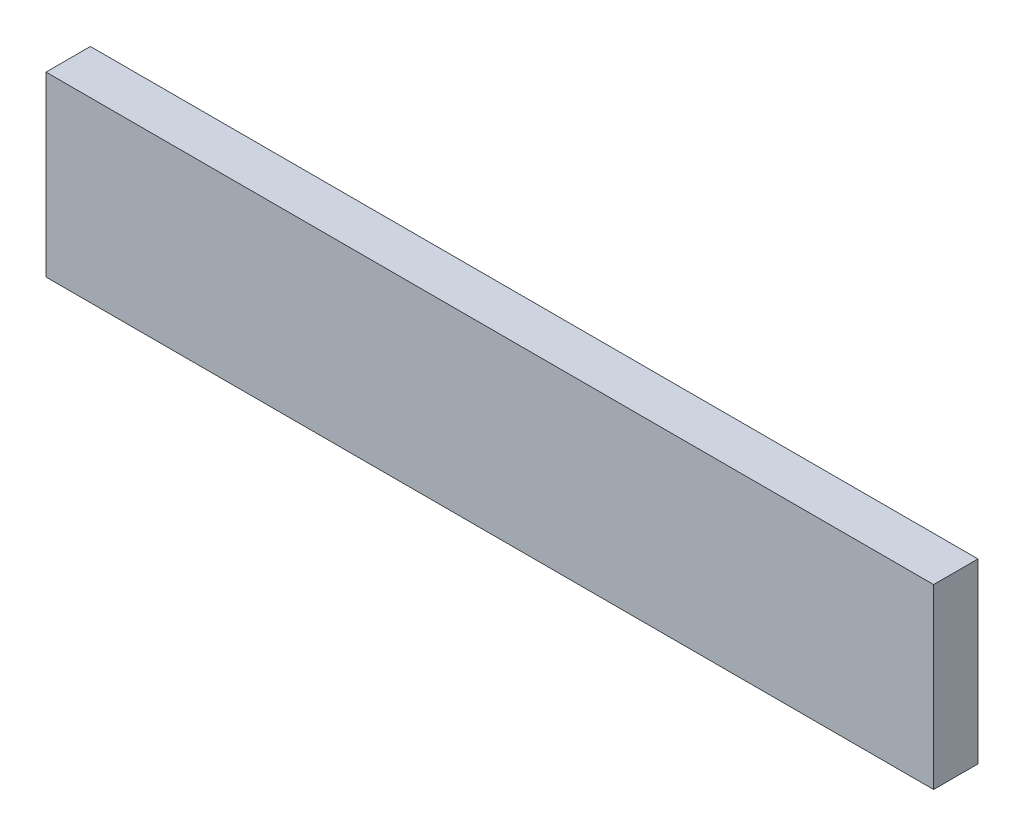
ISO-10303-21;
HEADER;
FILE_DESCRIPTION(('STEP AP214'),'2;1');
FILE_NAME('part.step','',(''),(''),'','','');
FILE_SCHEMA(('AUTOMOTIVE_DESIGN { 1 0 10303 214 1 1 1 1 }'));
ENDSEC;
DATA;
#1=APPLICATION_CONTEXT('core data for automotive mechanical design processes');
#2=APPLICATION_PROTOCOL_DEFINITION('international standard','automotive_design',2000,#1);
#3=PRODUCT_CONTEXT('',#1,'mechanical');
#4=PRODUCT('Part','Part','',(#3));
#5=PRODUCT_RELATED_PRODUCT_CATEGORY('part','',(#4));
#6=PRODUCT_DEFINITION_FORMATION('','',#4);
#7=PRODUCT_DEFINITION_CONTEXT('part definition',#1,'design');
#8=PRODUCT_DEFINITION('design','',#6,#7);
#9=PRODUCT_DEFINITION_SHAPE('','',#8);
#10=(LENGTH_UNIT() NAMED_UNIT(*) SI_UNIT(.MILLI.,.METRE.));
#11=(NAMED_UNIT(*) PLANE_ANGLE_UNIT() SI_UNIT($,.RADIAN.));
#12=(NAMED_UNIT(*) SI_UNIT($,.STERADIAN.) SOLID_ANGLE_UNIT());
#13=UNCERTAINTY_MEASURE_WITH_UNIT(LENGTH_MEASURE(1.E-05),#10,'distance_accuracy_value','');
#14=(GEOMETRIC_REPRESENTATION_CONTEXT(3) GLOBAL_UNCERTAINTY_ASSIGNED_CONTEXT((#13)) GLOBAL_UNIT_ASSIGNED_CONTEXT((#10,
#11,#12)) REPRESENTATION_CONTEXT('',''));
#15=CARTESIAN_POINT('',(0.,0.,0.));
#16=DIRECTION('',(0.,0.,1.));
#17=DIRECTION('',(1.,0.,0.));
#18=AXIS2_PLACEMENT_3D('',#15,#16,#17);
#19=CARTESIAN_POINT('',(-0.09999980000001,0.01999995999999,0.01));
#20=DIRECTION('',(0.,0.,-1.));
#21=DIRECTION('',(-1.,0.,0.));
#22=AXIS2_PLACEMENT_3D('',#19,#20,#21);
#23=PLANE('',#22);
#24=DIRECTION('',(1.,0.,0.));
#25=VECTOR('',#24,1.);
#26=CARTESIAN_POINT('',(-0.09999980000001,-0.01999996000001,0.01));
#27=LINE('',#26,#25);
#28=CARTESIAN_POINT('',(-0.09999980000001,-0.01999996000001,0.01));
#29=VERTEX_POINT('',#28);
#30=CARTESIAN_POINT('',(0.09999979999999,-0.01999996000001,0.01));
#31=VERTEX_POINT('',#30);
#32=EDGE_CURVE('E55',#29,#31,#27,.T.);
#33=ORIENTED_EDGE('',*,*,#32,.T.);
#34=DIRECTION('',(0.,1.,0.));
#35=VECTOR('',#34,1.);
#36=CARTESIAN_POINT('',(0.09999979999999,-0.01999996000001,0.01));
#37=LINE('',#36,#35);
#38=CARTESIAN_POINT('',(0.09999979999999,0.01999995999999,0.01));
#39=VERTEX_POINT('',#38);
#40=EDGE_CURVE('E57',#31,#39,#37,.T.);
#41=ORIENTED_EDGE('',*,*,#40,.T.);
#42=DIRECTION('',(1.,0.,0.));
#43=VECTOR('',#42,1.);
#44=CARTESIAN_POINT('',(0.09999979999999,0.01999995999999,0.01));
#45=LINE('',#44,#43);
#46=CARTESIAN_POINT('',(-0.09999980000001,0.01999995999999,0.01));
#47=VERTEX_POINT('',#46);
#48=EDGE_CURVE('E20',#39,#47,#45,.F.);
#49=ORIENTED_EDGE('',*,*,#48,.T.);
#50=DIRECTION('',(0.,1.,0.));
#51=VECTOR('',#50,1.);
#52=CARTESIAN_POINT('',(-0.09999980000001,0.01999995999999,0.01));
#53=LINE('',#52,#51);
#54=EDGE_CURVE('E80',#47,#29,#53,.F.);
#55=ORIENTED_EDGE('',*,*,#54,.T.);
#56=EDGE_LOOP('',(#33,#41,#49,#55));
#57=FACE_BOUND('',#56,.T.);
#58=ADVANCED_FACE('F17',(#57),#23,.F.);
#59=CARTESIAN_POINT('',(0.09999979999999,0.01999995999999,0.));
#60=DIRECTION('',(0.,-1.,0.));
#61=DIRECTION('',(0.,0.,-1.));
#62=AXIS2_PLACEMENT_3D('',#59,#60,#61);
#63=PLANE('',#62);
#64=DIRECTION('',(0.,0.,-1.));
#65=VECTOR('',#64,1.);
#66=CARTESIAN_POINT('',(-0.09999980000001,0.01999995999999,0.));
#67=LINE('',#66,#65);
#68=CARTESIAN_POINT('',(-0.09999980000001,0.01999995999999,0.));
#69=VERTEX_POINT('',#68);
#70=EDGE_CURVE('E68',#69,#47,#67,.F.);
#71=ORIENTED_EDGE('',*,*,#70,.T.);
#72=ORIENTED_EDGE('',*,*,#48,.F.);
#73=DIRECTION('',(0.,0.,1.));
#74=VECTOR('',#73,1.);
#75=CARTESIAN_POINT('',(0.09999979999999,0.01999995999999,0.));
#76=LINE('',#75,#74);
#77=CARTESIAN_POINT('',(0.09999979999999,0.01999995999999,0.));
#78=VERTEX_POINT('',#77);
#79=EDGE_CURVE('E63',#39,#78,#76,.F.);
#80=ORIENTED_EDGE('',*,*,#79,.T.);
#81=DIRECTION('',(-1.,0.,0.));
#82=VECTOR('',#81,1.);
#83=CARTESIAN_POINT('',(-0.09999980000001,0.01999995999999,0.));
#84=LINE('',#83,#82);
#85=EDGE_CURVE('E83',#69,#78,#84,.F.);
#86=ORIENTED_EDGE('',*,*,#85,.F.);
#87=EDGE_LOOP('',(#71,#72,#80,#86));
#88=FACE_BOUND('',#87,.T.);
#89=ADVANCED_FACE('F65',(#88),#63,.F.);
#90=CARTESIAN_POINT('',(0.09999979999999,-0.01999996000001,0.));
#91=DIRECTION('',(-1.,0.,0.));
#92=DIRECTION('',(0.,0.,1.));
#93=AXIS2_PLACEMENT_3D('',#90,#91,#92);
#94=PLANE('',#93);
#95=ORIENTED_EDGE('',*,*,#79,.F.);
#96=ORIENTED_EDGE('',*,*,#40,.F.);
#97=DIRECTION('',(0.,0.,1.));
#98=VECTOR('',#97,1.);
#99=CARTESIAN_POINT('',(0.09999979999999,-0.01999996000001,0.));
#100=LINE('',#99,#98);
#101=CARTESIAN_POINT('',(0.09999979999999,-0.01999996000001,0.));
#102=VERTEX_POINT('',#101);
#103=EDGE_CURVE('E75',#31,#102,#100,.F.);
#104=ORIENTED_EDGE('',*,*,#103,.T.);
#105=DIRECTION('',(0.,1.,0.));
#106=VECTOR('',#105,1.);
#107=CARTESIAN_POINT('',(0.09999979999999,0.01999995999999,0.));
#108=LINE('',#107,#106);
#109=EDGE_CURVE('E72',#78,#102,#108,.F.);
#110=ORIENTED_EDGE('',*,*,#109,.F.);
#111=EDGE_LOOP('',(#95,#96,#104,#110));
#112=FACE_BOUND('',#111,.T.);
#113=ADVANCED_FACE('F70',(#112),#94,.F.);
#114=CARTESIAN_POINT('',(-0.09999980000001,-0.01999996000001,0.));
#115=DIRECTION('',(0.,1.,0.));
#116=DIRECTION('',(0.,0.,1.));
#117=AXIS2_PLACEMENT_3D('',#114,#115,#116);
#118=PLANE('',#117);
#119=ORIENTED_EDGE('',*,*,#103,.F.);
#120=ORIENTED_EDGE('',*,*,#32,.F.);
#121=DIRECTION('',(0.,0.,-1.));
#122=VECTOR('',#121,1.);
#123=CARTESIAN_POINT('',(-0.09999980000001,-0.01999996000001,0.));
#124=LINE('',#123,#122);
#125=CARTESIAN_POINT('',(-0.09999980000001,-0.01999996000001,0.));
#126=VERTEX_POINT('',#125);
#127=EDGE_CURVE('E35',#29,#126,#124,.T.);
#128=ORIENTED_EDGE('',*,*,#127,.T.);
#129=DIRECTION('',(-1.,0.,0.));
#130=VECTOR('',#129,1.);
#131=CARTESIAN_POINT('',(-0.09999980000001,-0.01999996000001,0.));
#132=LINE('',#131,#130);
#133=EDGE_CURVE('E26',#102,#126,#132,.T.);
#134=ORIENTED_EDGE('',*,*,#133,.F.);
#135=EDGE_LOOP('',(#119,#120,#128,#134));
#136=FACE_BOUND('',#135,.T.);
#137=ADVANCED_FACE('F89',(#136),#118,.F.);
#138=CARTESIAN_POINT('',(-0.09999980000001,0.01999995999999,0.));
#139=DIRECTION('',(1.,0.,0.));
#140=DIRECTION('',(0.,0.,-1.));
#141=AXIS2_PLACEMENT_3D('',#138,#139,#140);
#142=PLANE('',#141);
#143=ORIENTED_EDGE('',*,*,#127,.F.);
#144=ORIENTED_EDGE('',*,*,#54,.F.);
#145=ORIENTED_EDGE('',*,*,#70,.F.);
#146=DIRECTION('',(0.,1.,0.));
#147=VECTOR('',#146,1.);
#148=CARTESIAN_POINT('',(-0.09999980000001,0.01999995999999,0.));
#149=LINE('',#148,#147);
#150=EDGE_CURVE('E11',#126,#69,#149,.T.);
#151=ORIENTED_EDGE('',*,*,#150,.F.);
#152=EDGE_LOOP('',(#143,#144,#145,#151));
#153=FACE_BOUND('',#152,.T.);
#154=ADVANCED_FACE('F91',(#153),#142,.F.);
#155=CARTESIAN_POINT('',(-0.09999980000001,0.01999995999999,0.));
#156=DIRECTION('',(0.,0.,-1.));
#157=DIRECTION('',(-1.,0.,0.));
#158=AXIS2_PLACEMENT_3D('',#155,#156,#157);
#159=PLANE('',#158);
#160=ORIENTED_EDGE('',*,*,#133,.T.);
#161=ORIENTED_EDGE('',*,*,#150,.T.);
#162=ORIENTED_EDGE('',*,*,#85,.T.);
#163=ORIENTED_EDGE('',*,*,#109,.T.);
#164=EDGE_LOOP('',(#160,#161,#162,#163));
#165=FACE_BOUND('',#164,.T.);
#166=ADVANCED_FACE('F88',(#165),#159,.T.);
#167=CLOSED_SHELL('',(#58,#89,#113,#137,#154,#166));
#168=MANIFOLD_SOLID_BREP('B1',#167);
#169=ADVANCED_BREP_SHAPE_REPRESENTATION('',(#18,#168),#14);
#170=SHAPE_DEFINITION_REPRESENTATION(#9,#169);
ENDSEC;
END-ISO-10303-21;
